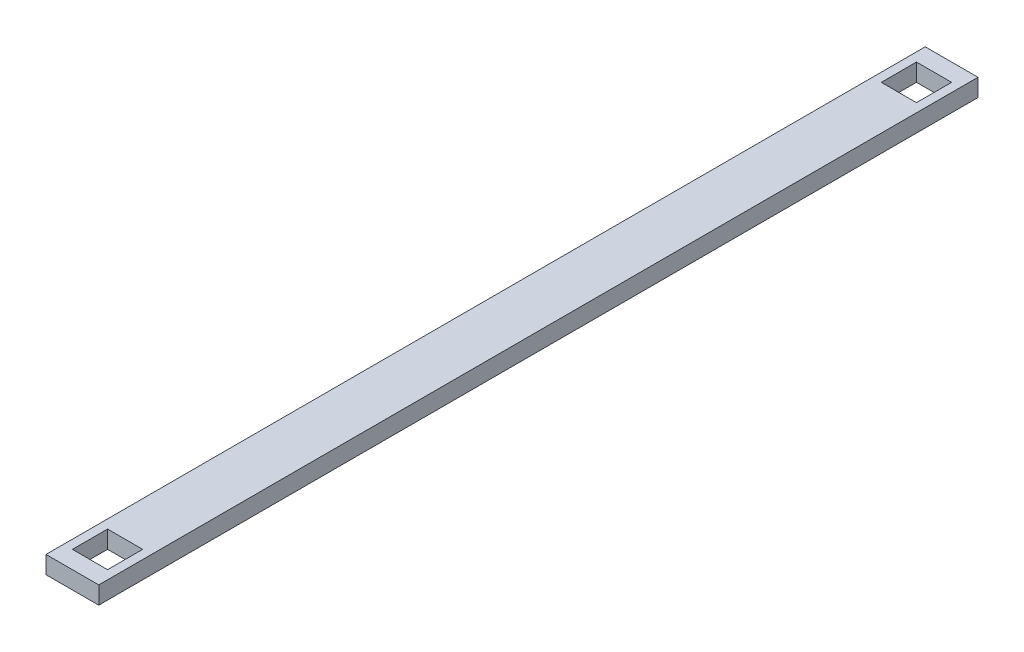
ISO-10303-21;
HEADER;
FILE_DESCRIPTION(('STEP AP214'),'2;1');
FILE_NAME('part.step','',(''),(''),'','','');
FILE_SCHEMA(('AUTOMOTIVE_DESIGN { 1 0 10303 214 1 1 1 1 }'));
ENDSEC;
DATA;
#1=APPLICATION_CONTEXT('core data for automotive mechanical design processes');
#2=APPLICATION_PROTOCOL_DEFINITION('international standard','automotive_design',2000,#1);
#3=PRODUCT_CONTEXT('',#1,'mechanical');
#4=PRODUCT('Part','Part','',(#3));
#5=PRODUCT_RELATED_PRODUCT_CATEGORY('part','',(#4));
#6=PRODUCT_DEFINITION_FORMATION('','',#4);
#7=PRODUCT_DEFINITION_CONTEXT('part definition',#1,'design');
#8=PRODUCT_DEFINITION('design','',#6,#7);
#9=PRODUCT_DEFINITION_SHAPE('','',#8);
#10=(LENGTH_UNIT() NAMED_UNIT(*) SI_UNIT(.MILLI.,.METRE.));
#11=(NAMED_UNIT(*) PLANE_ANGLE_UNIT() SI_UNIT($,.RADIAN.));
#12=(NAMED_UNIT(*) SI_UNIT($,.STERADIAN.) SOLID_ANGLE_UNIT());
#13=UNCERTAINTY_MEASURE_WITH_UNIT(LENGTH_MEASURE(1.E-05),#10,'distance_accuracy_value','');
#14=(GEOMETRIC_REPRESENTATION_CONTEXT(3) GLOBAL_UNCERTAINTY_ASSIGNED_CONTEXT((#13)) GLOBAL_UNIT_ASSIGNED_CONTEXT((#10,
#11,#12)) REPRESENTATION_CONTEXT('',''));
#15=CARTESIAN_POINT('',(0.,0.,0.));
#16=DIRECTION('',(0.,0.,1.));
#17=DIRECTION('',(1.,0.,0.));
#18=AXIS2_PLACEMENT_3D('',#15,#16,#17);
#19=CARTESIAN_POINT('',(0.,0.,-50.));
#20=DIRECTION('',(-1.,0.,0.));
#21=DIRECTION('',(0.,0.,1.));
#22=AXIS2_PLACEMENT_3D('',#19,#20,#21);
#23=PLANE('',#22);
#24=DIRECTION('',(0.,-1.,0.));
#25=VECTOR('',#24,1.);
#26=CARTESIAN_POINT('',(0.,0.,0.));
#27=LINE('',#26,#25);
#28=CARTESIAN_POINT('',(0.,1.,0.));
#29=VERTEX_POINT('',#28);
#30=CARTESIAN_POINT('',(0.,0.,0.));
#31=VERTEX_POINT('',#30);
#32=EDGE_CURVE('E151',#29,#31,#27,.T.);
#33=ORIENTED_EDGE('',*,*,#32,.F.);
#34=DIRECTION('',(0.,0.,1.));
#35=VECTOR('',#34,1.);
#36=CARTESIAN_POINT('',(0.,1.,-50.));
#37=LINE('',#36,#35);
#38=CARTESIAN_POINT('',(0.,1.,-50.));
#39=VERTEX_POINT('',#38);
#40=EDGE_CURVE('E196',#39,#29,#37,.T.);
#41=ORIENTED_EDGE('',*,*,#40,.F.);
#42=DIRECTION('',(0.,-1.,0.));
#43=VECTOR('',#42,1.);
#44=CARTESIAN_POINT('',(0.,0.,-50.));
#45=LINE('',#44,#43);
#46=CARTESIAN_POINT('',(0.,0.,-50.));
#47=VERTEX_POINT('',#46);
#48=EDGE_CURVE('E172',#39,#47,#45,.T.);
#49=ORIENTED_EDGE('',*,*,#48,.T.);
#50=DIRECTION('',(0.,0.,1.));
#51=VECTOR('',#50,1.);
#52=CARTESIAN_POINT('',(0.,0.,-50.));
#53=LINE('',#52,#51);
#54=EDGE_CURVE('E185',#47,#31,#53,.T.);
#55=ORIENTED_EDGE('',*,*,#54,.T.);
#56=EDGE_LOOP('',(#33,#41,#49,#55));
#57=FACE_BOUND('',#56,.T.);
#58=ADVANCED_FACE('F33',(#57),#23,.T.);
#59=CARTESIAN_POINT('',(0.,1.,-50.));
#60=DIRECTION('',(0.,1.,0.));
#61=DIRECTION('',(0.,0.,1.));
#62=AXIS2_PLACEMENT_3D('',#59,#60,#61);
#63=PLANE('',#62);
#64=DIRECTION('',(0.,0.,1.));
#65=VECTOR('',#64,1.);
#66=CARTESIAN_POINT('',(0.500000000000006,1.,-3.));
#67=LINE('',#66,#65);
#68=CARTESIAN_POINT('',(0.500000000000006,1.,-3.));
#69=VERTEX_POINT('',#68);
#70=CARTESIAN_POINT('',(0.500000000000006,1.,-1.));
#71=VERTEX_POINT('',#70);
#72=EDGE_CURVE('E47',#69,#71,#67,.T.);
#73=ORIENTED_EDGE('',*,*,#72,.F.);
#74=DIRECTION('',(-1.,0.,0.));
#75=VECTOR('',#74,1.);
#76=CARTESIAN_POINT('',(0.500000000000006,1.,-3.));
#77=LINE('',#76,#75);
#78=CARTESIAN_POINT('',(2.50000000000001,1.,-3.));
#79=VERTEX_POINT('',#78);
#80=EDGE_CURVE('E144',#79,#69,#77,.T.);
#81=ORIENTED_EDGE('',*,*,#80,.F.);
#82=DIRECTION('',(0.,0.,-1.));
#83=VECTOR('',#82,1.);
#84=CARTESIAN_POINT('',(2.50000000000001,1.,-3.));
#85=LINE('',#84,#83);
#86=CARTESIAN_POINT('',(2.50000000000001,1.,-1.));
#87=VERTEX_POINT('',#86);
#88=EDGE_CURVE('E127',#87,#79,#85,.T.);
#89=ORIENTED_EDGE('',*,*,#88,.F.);
#90=DIRECTION('',(1.,0.,0.));
#91=VECTOR('',#90,1.);
#92=CARTESIAN_POINT('',(0.500000000000006,1.,-1.));
#93=LINE('',#92,#91);
#94=EDGE_CURVE('E137',#71,#87,#93,.T.);
#95=ORIENTED_EDGE('',*,*,#94,.F.);
#96=EDGE_LOOP('',(#73,#81,#89,#95));
#97=FACE_BOUND('',#96,.T.);
#98=DIRECTION('',(1.,0.,0.));
#99=VECTOR('',#98,1.);
#100=CARTESIAN_POINT('',(0.500000000000006,1.,-47.));
#101=LINE('',#100,#99);
#102=CARTESIAN_POINT('',(0.500000000000006,1.,-47.));
#103=VERTEX_POINT('',#102);
#104=CARTESIAN_POINT('',(2.50000000000001,1.,-47.));
#105=VERTEX_POINT('',#104);
#106=EDGE_CURVE('E55',#103,#105,#101,.T.);
#107=ORIENTED_EDGE('',*,*,#106,.F.);
#108=DIRECTION('',(0.,0.,1.));
#109=VECTOR('',#108,1.);
#110=CARTESIAN_POINT('',(0.500000000000006,1.,-47.));
#111=LINE('',#110,#109);
#112=CARTESIAN_POINT('',(0.500000000000006,1.,-49.));
#113=VERTEX_POINT('',#112);
#114=EDGE_CURVE('E161',#113,#103,#111,.T.);
#115=ORIENTED_EDGE('',*,*,#114,.F.);
#116=DIRECTION('',(-1.,0.,0.));
#117=VECTOR('',#116,1.);
#118=CARTESIAN_POINT('',(0.500000000000006,1.,-49.));
#119=LINE('',#118,#117);
#120=CARTESIAN_POINT('',(2.50000000000001,1.,-49.));
#121=VERTEX_POINT('',#120);
#122=EDGE_CURVE('E158',#121,#113,#119,.T.);
#123=ORIENTED_EDGE('',*,*,#122,.F.);
#124=DIRECTION('',(0.,0.,-1.));
#125=VECTOR('',#124,1.);
#126=CARTESIAN_POINT('',(2.50000000000001,1.,-47.));
#127=LINE('',#126,#125);
#128=EDGE_CURVE('E155',#105,#121,#127,.T.);
#129=ORIENTED_EDGE('',*,*,#128,.F.);
#130=EDGE_LOOP('',(#107,#115,#123,#129));
#131=FACE_BOUND('',#130,.T.);
#132=DIRECTION('',(-1.,0.,0.));
#133=VECTOR('',#132,1.);
#134=CARTESIAN_POINT('',(0.,1.,0.));
#135=LINE('',#134,#133);
#136=CARTESIAN_POINT('',(3.,1.,0.));
#137=VERTEX_POINT('',#136);
#138=EDGE_CURVE('E176',#137,#29,#135,.T.);
#139=ORIENTED_EDGE('',*,*,#138,.F.);
#140=DIRECTION('',(0.,0.,1.));
#141=VECTOR('',#140,1.);
#142=CARTESIAN_POINT('',(3.,1.,-50.));
#143=LINE('',#142,#141);
#144=CARTESIAN_POINT('',(3.,1.,-50.));
#145=VERTEX_POINT('',#144);
#146=EDGE_CURVE('E199',#145,#137,#143,.T.);
#147=ORIENTED_EDGE('',*,*,#146,.F.);
#148=DIRECTION('',(-1.,0.,0.));
#149=VECTOR('',#148,1.);
#150=CARTESIAN_POINT('',(0.,1.,-50.));
#151=LINE('',#150,#149);
#152=EDGE_CURVE('E182',#145,#39,#151,.T.);
#153=ORIENTED_EDGE('',*,*,#152,.T.);
#154=ORIENTED_EDGE('',*,*,#40,.T.);
#155=EDGE_LOOP('',(#139,#147,#153,#154));
#156=FACE_BOUND('',#155,.T.);
#157=ADVANCED_FACE('F141',(#97,#131,#156),#63,.T.);
#158=CARTESIAN_POINT('',(3.,0.,-50.));
#159=DIRECTION('',(1.,0.,0.));
#160=DIRECTION('',(0.,0.,-1.));
#161=AXIS2_PLACEMENT_3D('',#158,#159,#160);
#162=PLANE('',#161);
#163=DIRECTION('',(0.,1.,0.));
#164=VECTOR('',#163,1.);
#165=CARTESIAN_POINT('',(3.,0.,0.));
#166=LINE('',#165,#164);
#167=CARTESIAN_POINT('',(3.,0.,0.));
#168=VERTEX_POINT('',#167);
#169=EDGE_CURVE('E191',#168,#137,#166,.T.);
#170=ORIENTED_EDGE('',*,*,#169,.F.);
#171=DIRECTION('',(0.,0.,1.));
#172=VECTOR('',#171,1.);
#173=CARTESIAN_POINT('',(3.,0.,-50.));
#174=LINE('',#173,#172);
#175=CARTESIAN_POINT('',(3.,0.,-50.));
#176=VERTEX_POINT('',#175);
#177=EDGE_CURVE('E201',#176,#168,#174,.T.);
#178=ORIENTED_EDGE('',*,*,#177,.F.);
#179=DIRECTION('',(0.,1.,0.));
#180=VECTOR('',#179,1.);
#181=CARTESIAN_POINT('',(3.,0.,-50.));
#182=LINE('',#181,#180);
#183=EDGE_CURVE('E179',#176,#145,#182,.T.);
#184=ORIENTED_EDGE('',*,*,#183,.T.);
#185=ORIENTED_EDGE('',*,*,#146,.T.);
#186=EDGE_LOOP('',(#170,#178,#184,#185));
#187=FACE_BOUND('',#186,.T.);
#188=ADVANCED_FACE('F241',(#187),#162,.T.);
#189=CARTESIAN_POINT('',(0.,0.,-50.));
#190=DIRECTION('',(0.,-1.,0.));
#191=DIRECTION('',(0.,0.,-1.));
#192=AXIS2_PLACEMENT_3D('',#189,#190,#191);
#193=PLANE('',#192);
#194=DIRECTION('',(0.,0.,-1.));
#195=VECTOR('',#194,1.);
#196=CARTESIAN_POINT('',(0.499999999999998,0.,-50.));
#197=LINE('',#196,#195);
#198=CARTESIAN_POINT('',(0.500000000000006,0.,-1.));
#199=VERTEX_POINT('',#198);
#200=CARTESIAN_POINT('',(0.500000000000006,0.,-3.));
#201=VERTEX_POINT('',#200);
#202=EDGE_CURVE('E11',#199,#201,#197,.T.);
#203=ORIENTED_EDGE('',*,*,#202,.F.);
#204=DIRECTION('',(-1.,0.,0.));
#205=VECTOR('',#204,1.);
#206=CARTESIAN_POINT('',(0.,0.,-1.));
#207=LINE('',#206,#205);
#208=CARTESIAN_POINT('',(2.50000000000001,0.,-1.));
#209=VERTEX_POINT('',#208);
#210=EDGE_CURVE('E212',#209,#199,#207,.T.);
#211=ORIENTED_EDGE('',*,*,#210,.F.);
#212=DIRECTION('',(0.,0.,1.));
#213=VECTOR('',#212,1.);
#214=CARTESIAN_POINT('',(2.5,0.,-50.));
#215=LINE('',#214,#213);
#216=CARTESIAN_POINT('',(2.50000000000001,0.,-3.));
#217=VERTEX_POINT('',#216);
#218=EDGE_CURVE('E130',#217,#209,#215,.T.);
#219=ORIENTED_EDGE('',*,*,#218,.F.);
#220=DIRECTION('',(1.,0.,0.));
#221=VECTOR('',#220,1.);
#222=CARTESIAN_POINT('',(0.,0.,-3.));
#223=LINE('',#222,#221);
#224=EDGE_CURVE('E40',#201,#217,#223,.T.);
#225=ORIENTED_EDGE('',*,*,#224,.F.);
#226=EDGE_LOOP('',(#203,#211,#219,#225));
#227=FACE_BOUND('',#226,.T.);
#228=DIRECTION('',(-1.,0.,0.));
#229=VECTOR('',#228,1.);
#230=CARTESIAN_POINT('',(0.,0.,-47.));
#231=LINE('',#230,#229);
#232=CARTESIAN_POINT('',(2.50000000000001,0.,-47.));
#233=VERTEX_POINT('',#232);
#234=CARTESIAN_POINT('',(0.500000000000006,0.,-47.));
#235=VERTEX_POINT('',#234);
#236=EDGE_CURVE('E210',#233,#235,#231,.T.);
#237=ORIENTED_EDGE('',*,*,#236,.F.);
#238=DIRECTION('',(0.,0.,1.));
#239=VECTOR('',#238,1.);
#240=CARTESIAN_POINT('',(2.50000000000001,0.,-50.));
#241=LINE('',#240,#239);
#242=CARTESIAN_POINT('',(2.50000000000001,0.,-49.));
#243=VERTEX_POINT('',#242);
#244=EDGE_CURVE('E198',#243,#233,#241,.T.);
#245=ORIENTED_EDGE('',*,*,#244,.F.);
#246=DIRECTION('',(1.,0.,0.));
#247=VECTOR('',#246,1.);
#248=CARTESIAN_POINT('',(0.,0.,-49.));
#249=LINE('',#248,#247);
#250=CARTESIAN_POINT('',(0.500000000000006,0.,-49.));
#251=VERTEX_POINT('',#250);
#252=EDGE_CURVE('E205',#251,#243,#249,.T.);
#253=ORIENTED_EDGE('',*,*,#252,.F.);
#254=DIRECTION('',(0.,0.,-1.));
#255=VECTOR('',#254,1.);
#256=CARTESIAN_POINT('',(0.500000000000006,0.,-50.));
#257=LINE('',#256,#255);
#258=EDGE_CURVE('E208',#235,#251,#257,.T.);
#259=ORIENTED_EDGE('',*,*,#258,.F.);
#260=EDGE_LOOP('',(#237,#245,#253,#259));
#261=FACE_BOUND('',#260,.T.);
#262=DIRECTION('',(1.,0.,0.));
#263=VECTOR('',#262,1.);
#264=CARTESIAN_POINT('',(0.,0.,0.));
#265=LINE('',#264,#263);
#266=EDGE_CURVE('E188',#31,#168,#265,.T.);
#267=ORIENTED_EDGE('',*,*,#266,.F.);
#268=ORIENTED_EDGE('',*,*,#54,.F.);
#269=DIRECTION('',(1.,0.,0.));
#270=VECTOR('',#269,1.);
#271=CARTESIAN_POINT('',(0.,0.,-50.));
#272=LINE('',#271,#270);
#273=EDGE_CURVE('E175',#47,#176,#272,.T.);
#274=ORIENTED_EDGE('',*,*,#273,.T.);
#275=ORIENTED_EDGE('',*,*,#177,.T.);
#276=EDGE_LOOP('',(#267,#268,#274,#275));
#277=FACE_BOUND('',#276,.T.);
#278=ADVANCED_FACE('F220',(#227,#261,#277),#193,.T.);
#279=CARTESIAN_POINT('',(0.,0.,-50.));
#280=DIRECTION('',(0.,0.,-1.));
#281=DIRECTION('',(-1.,0.,0.));
#282=AXIS2_PLACEMENT_3D('',#279,#280,#281);
#283=PLANE('',#282);
#284=ORIENTED_EDGE('',*,*,#48,.F.);
#285=ORIENTED_EDGE('',*,*,#152,.F.);
#286=ORIENTED_EDGE('',*,*,#183,.F.);
#287=ORIENTED_EDGE('',*,*,#273,.F.);
#288=EDGE_LOOP('',(#284,#285,#286,#287));
#289=FACE_BOUND('',#288,.T.);
#290=ADVANCED_FACE('F254',(#289),#283,.T.);
#291=CARTESIAN_POINT('',(0.,0.,0.));
#292=DIRECTION('',(0.,0.,-1.));
#293=DIRECTION('',(-1.,0.,0.));
#294=AXIS2_PLACEMENT_3D('',#291,#292,#293);
#295=PLANE('',#294);
#296=ORIENTED_EDGE('',*,*,#32,.T.);
#297=ORIENTED_EDGE('',*,*,#266,.T.);
#298=ORIENTED_EDGE('',*,*,#169,.T.);
#299=ORIENTED_EDGE('',*,*,#138,.T.);
#300=EDGE_LOOP('',(#296,#297,#298,#299));
#301=FACE_BOUND('',#300,.T.);
#302=ADVANCED_FACE('F248',(#301),#295,.F.);
#303=CARTESIAN_POINT('',(0.500000000000006,-43.,-47.));
#304=DIRECTION('',(0.,0.,1.));
#305=DIRECTION('',(1.,0.,0.));
#306=AXIS2_PLACEMENT_3D('',#303,#304,#305);
#307=PLANE('',#306);
#308=ORIENTED_EDGE('',*,*,#236,.T.);
#309=DIRECTION('',(0.,1.,0.));
#310=VECTOR('',#309,1.);
#311=CARTESIAN_POINT('',(0.500000000000006,-43.,-47.));
#312=LINE('',#311,#310);
#313=EDGE_CURVE('E165',#235,#103,#312,.T.);
#314=ORIENTED_EDGE('',*,*,#313,.T.);
#315=ORIENTED_EDGE('',*,*,#106,.T.);
#316=DIRECTION('',(0.,1.,0.));
#317=VECTOR('',#316,1.);
#318=CARTESIAN_POINT('',(2.50000000000001,-43.,-47.));
#319=LINE('',#318,#317);
#320=EDGE_CURVE('E164',#233,#105,#319,.T.);
#321=ORIENTED_EDGE('',*,*,#320,.F.);
#322=EDGE_LOOP('',(#308,#314,#315,#321));
#323=FACE_BOUND('',#322,.T.);
#324=ADVANCED_FACE('F266',(#323),#307,.F.);
#325=CARTESIAN_POINT('',(0.500000000000006,-43.,-47.));
#326=DIRECTION('',(-1.,0.,0.));
#327=DIRECTION('',(0.,0.,1.));
#328=AXIS2_PLACEMENT_3D('',#325,#326,#327);
#329=PLANE('',#328);
#330=ORIENTED_EDGE('',*,*,#258,.T.);
#331=DIRECTION('',(0.,1.,0.));
#332=VECTOR('',#331,1.);
#333=CARTESIAN_POINT('',(0.500000000000006,-43.,-49.));
#334=LINE('',#333,#332);
#335=EDGE_CURVE('E167',#251,#113,#334,.T.);
#336=ORIENTED_EDGE('',*,*,#335,.T.);
#337=ORIENTED_EDGE('',*,*,#114,.T.);
#338=ORIENTED_EDGE('',*,*,#313,.F.);
#339=EDGE_LOOP('',(#330,#336,#337,#338));
#340=FACE_BOUND('',#339,.T.);
#341=ADVANCED_FACE('F270',(#340),#329,.F.);
#342=CARTESIAN_POINT('',(0.500000000000006,-43.,-49.));
#343=DIRECTION('',(0.,0.,-1.));
#344=DIRECTION('',(-1.,0.,0.));
#345=AXIS2_PLACEMENT_3D('',#342,#343,#344);
#346=PLANE('',#345);
#347=ORIENTED_EDGE('',*,*,#252,.T.);
#348=DIRECTION('',(0.,1.,0.));
#349=VECTOR('',#348,1.);
#350=CARTESIAN_POINT('',(2.50000000000001,-43.,-49.));
#351=LINE('',#350,#349);
#352=EDGE_CURVE('E169',#243,#121,#351,.T.);
#353=ORIENTED_EDGE('',*,*,#352,.T.);
#354=ORIENTED_EDGE('',*,*,#122,.T.);
#355=ORIENTED_EDGE('',*,*,#335,.F.);
#356=EDGE_LOOP('',(#347,#353,#354,#355));
#357=FACE_BOUND('',#356,.T.);
#358=ADVANCED_FACE('F231',(#357),#346,.F.);
#359=CARTESIAN_POINT('',(2.50000000000001,-43.,-47.));
#360=DIRECTION('',(1.,0.,0.));
#361=DIRECTION('',(0.,0.,-1.));
#362=AXIS2_PLACEMENT_3D('',#359,#360,#361);
#363=PLANE('',#362);
#364=ORIENTED_EDGE('',*,*,#244,.T.);
#365=ORIENTED_EDGE('',*,*,#320,.T.);
#366=ORIENTED_EDGE('',*,*,#128,.T.);
#367=ORIENTED_EDGE('',*,*,#352,.F.);
#368=EDGE_LOOP('',(#364,#365,#366,#367));
#369=FACE_BOUND('',#368,.T.);
#370=ADVANCED_FACE('F224',(#369),#363,.F.);
#371=CARTESIAN_POINT('',(0.500000000000006,-43.,-3.));
#372=DIRECTION('',(-1.,0.,0.));
#373=DIRECTION('',(0.,0.,1.));
#374=AXIS2_PLACEMENT_3D('',#371,#372,#373);
#375=PLANE('',#374);
#376=ORIENTED_EDGE('',*,*,#202,.T.);
#377=DIRECTION('',(0.,1.,0.));
#378=VECTOR('',#377,1.);
#379=CARTESIAN_POINT('',(0.500000000000006,-43.,-3.));
#380=LINE('',#379,#378);
#381=EDGE_CURVE('E149',#201,#69,#380,.T.);
#382=ORIENTED_EDGE('',*,*,#381,.T.);
#383=ORIENTED_EDGE('',*,*,#72,.T.);
#384=DIRECTION('',(0.,1.,0.));
#385=VECTOR('',#384,1.);
#386=CARTESIAN_POINT('',(0.500000000000006,-43.,-1.));
#387=LINE('',#386,#385);
#388=EDGE_CURVE('E134',#199,#71,#387,.T.);
#389=ORIENTED_EDGE('',*,*,#388,.F.);
#390=EDGE_LOOP('',(#376,#382,#383,#389));
#391=FACE_BOUND('',#390,.T.);
#392=ADVANCED_FACE('F222',(#391),#375,.F.);
#393=CARTESIAN_POINT('',(0.500000000000006,-43.,-3.));
#394=DIRECTION('',(0.,0.,-1.));
#395=DIRECTION('',(-1.,0.,0.));
#396=AXIS2_PLACEMENT_3D('',#393,#394,#395);
#397=PLANE('',#396);
#398=ORIENTED_EDGE('',*,*,#224,.T.);
#399=DIRECTION('',(0.,1.,0.));
#400=VECTOR('',#399,1.);
#401=CARTESIAN_POINT('',(2.50000000000001,-43.,-3.));
#402=LINE('',#401,#400);
#403=EDGE_CURVE('E133',#217,#79,#402,.T.);
#404=ORIENTED_EDGE('',*,*,#403,.T.);
#405=ORIENTED_EDGE('',*,*,#80,.T.);
#406=ORIENTED_EDGE('',*,*,#381,.F.);
#407=EDGE_LOOP('',(#398,#404,#405,#406));
#408=FACE_BOUND('',#407,.T.);
#409=ADVANCED_FACE('F217',(#408),#397,.F.);
#410=CARTESIAN_POINT('',(2.50000000000001,-43.,-3.));
#411=DIRECTION('',(1.,0.,0.));
#412=DIRECTION('',(0.,0.,-1.));
#413=AXIS2_PLACEMENT_3D('',#410,#411,#412);
#414=PLANE('',#413);
#415=ORIENTED_EDGE('',*,*,#218,.T.);
#416=DIRECTION('',(0.,1.,0.));
#417=VECTOR('',#416,1.);
#418=CARTESIAN_POINT('',(2.50000000000001,-43.,-1.));
#419=LINE('',#418,#417);
#420=EDGE_CURVE('E122',#209,#87,#419,.T.);
#421=ORIENTED_EDGE('',*,*,#420,.T.);
#422=ORIENTED_EDGE('',*,*,#88,.T.);
#423=ORIENTED_EDGE('',*,*,#403,.F.);
#424=EDGE_LOOP('',(#415,#421,#422,#423));
#425=FACE_BOUND('',#424,.T.);
#426=ADVANCED_FACE('F124',(#425),#414,.F.);
#427=CARTESIAN_POINT('',(0.500000000000006,-43.,-1.));
#428=DIRECTION('',(0.,0.,1.));
#429=DIRECTION('',(1.,0.,0.));
#430=AXIS2_PLACEMENT_3D('',#427,#428,#429);
#431=PLANE('',#430);
#432=ORIENTED_EDGE('',*,*,#210,.T.);
#433=ORIENTED_EDGE('',*,*,#388,.T.);
#434=ORIENTED_EDGE('',*,*,#94,.T.);
#435=ORIENTED_EDGE('',*,*,#420,.F.);
#436=EDGE_LOOP('',(#432,#433,#434,#435));
#437=FACE_BOUND('',#436,.T.);
#438=ADVANCED_FACE('F138',(#437),#431,.F.);
#439=CLOSED_SHELL('',(#58,#157,#188,#278,#290,#302,#324,#341,#358,#370,#392,#409,#426,#438));
#440=MANIFOLD_SOLID_BREP('B2',#439);
#441=ADVANCED_BREP_SHAPE_REPRESENTATION('',(#18,#440),#14);
#442=SHAPE_DEFINITION_REPRESENTATION(#9,#441);
ENDSEC;
END-ISO-10303-21;
